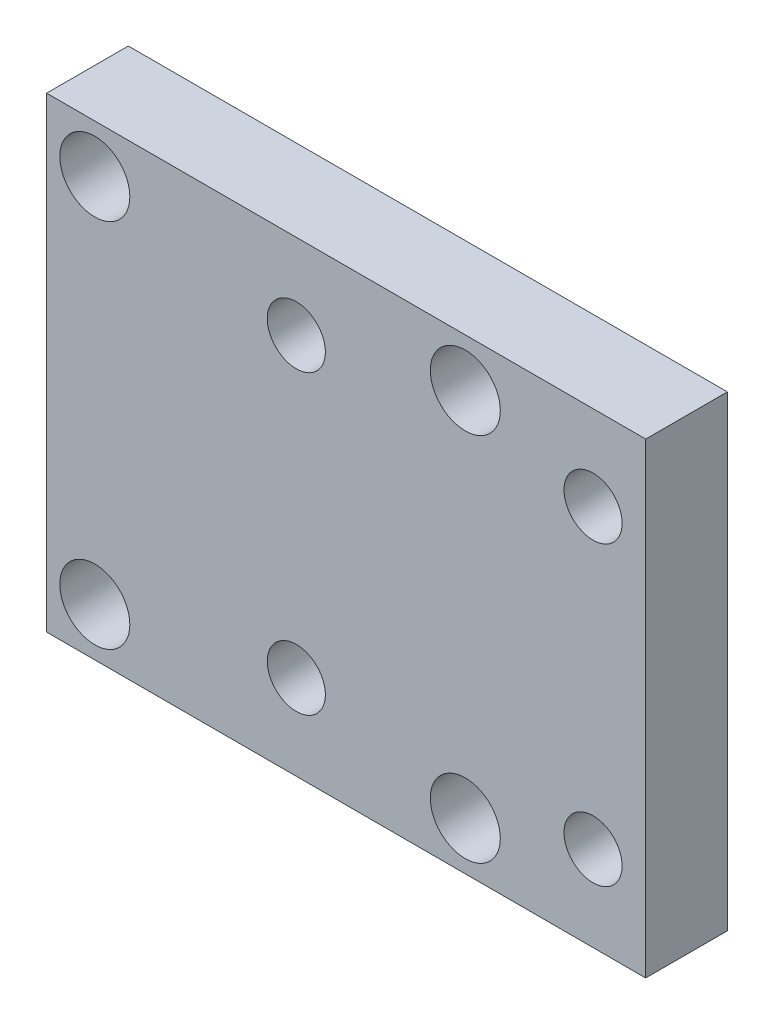
ISO-10303-21;
HEADER;
FILE_DESCRIPTION(('STEP AP214'),'2;1');
FILE_NAME('part.step','',(''),(''),'','','');
FILE_SCHEMA(('AUTOMOTIVE_DESIGN { 1 0 10303 214 1 1 1 1 }'));
ENDSEC;
DATA;
#1=APPLICATION_CONTEXT('core data for automotive mechanical design processes');
#2=APPLICATION_PROTOCOL_DEFINITION('international standard','automotive_design',2000,#1);
#3=PRODUCT_CONTEXT('',#1,'mechanical');
#4=PRODUCT('Part','Part','',(#3));
#5=PRODUCT_RELATED_PRODUCT_CATEGORY('part','',(#4));
#6=PRODUCT_DEFINITION_FORMATION('','',#4);
#7=PRODUCT_DEFINITION_CONTEXT('part definition',#1,'design');
#8=PRODUCT_DEFINITION('design','',#6,#7);
#9=PRODUCT_DEFINITION_SHAPE('','',#8);
#10=(LENGTH_UNIT() NAMED_UNIT(*) SI_UNIT(.MILLI.,.METRE.));
#11=(NAMED_UNIT(*) PLANE_ANGLE_UNIT() SI_UNIT($,.RADIAN.));
#12=(NAMED_UNIT(*) SI_UNIT($,.STERADIAN.) SOLID_ANGLE_UNIT());
#13=UNCERTAINTY_MEASURE_WITH_UNIT(LENGTH_MEASURE(1.E-05),#10,'distance_accuracy_value','');
#14=(GEOMETRIC_REPRESENTATION_CONTEXT(3) GLOBAL_UNCERTAINTY_ASSIGNED_CONTEXT((#13)) GLOBAL_UNIT_ASSIGNED_CONTEXT((#10,
#11,#12)) REPRESENTATION_CONTEXT('',''));
#15=CARTESIAN_POINT('',(0.,0.,0.));
#16=DIRECTION('',(0.,0.,1.));
#17=DIRECTION('',(1.,0.,0.));
#18=AXIS2_PLACEMENT_3D('',#15,#16,#17);
#19=CARTESIAN_POINT('',(-61.3,-35.875,7.));
#20=DIRECTION('',(0.,0.,-1.));
#21=DIRECTION('',(-1.,0.,0.));
#22=AXIS2_PLACEMENT_3D('',#19,#20,#21);
#23=CYLINDRICAL_SURFACE('',#22,2.);
#24=CARTESIAN_POINT('',(-61.3,-35.875,0.));
#25=DIRECTION('',(0.,0.,1.));
#26=DIRECTION('',(1.,0.,0.));
#27=AXIS2_PLACEMENT_3D('',#24,#25,#26);
#28=CIRCLE('',#27,2.);
#29=CARTESIAN_POINT('',(-59.3,-35.875,0.));
#30=VERTEX_POINT('',#29);
#31=EDGE_CURVE('E104',#30,#30,#28,.T.);
#32=ORIENTED_EDGE('',*,*,#31,.F.);
#33=EDGE_LOOP('',(#32));
#34=FACE_BOUND('',#33,.T.);
#35=CARTESIAN_POINT('',(-61.3,-35.875,1.));
#36=DIRECTION('',(0.,0.,1.));
#37=DIRECTION('',(1.,0.,0.));
#38=AXIS2_PLACEMENT_3D('',#35,#36,#37);
#39=CIRCLE('',#38,2.);
#40=CARTESIAN_POINT('',(-59.3,-35.875,1.));
#41=VERTEX_POINT('',#40);
#42=EDGE_CURVE('E38',#41,#41,#39,.T.);
#43=ORIENTED_EDGE('',*,*,#42,.T.);
#44=EDGE_LOOP('',(#43));
#45=FACE_BOUND('',#44,.T.);
#46=ADVANCED_FACE('F34',(#34,#45),#23,.F.);
#47=CARTESIAN_POINT('',(-29.55,-35.875,7.));
#48=DIRECTION('',(0.,0.,-1.));
#49=DIRECTION('',(-1.,0.,0.));
#50=AXIS2_PLACEMENT_3D('',#47,#48,#49);
#51=CYLINDRICAL_SURFACE('',#50,2.);
#52=CARTESIAN_POINT('',(-29.55,-35.875,0.));
#53=DIRECTION('',(0.,0.,1.));
#54=DIRECTION('',(1.,0.,0.));
#55=AXIS2_PLACEMENT_3D('',#52,#53,#54);
#56=CIRCLE('',#55,2.);
#57=CARTESIAN_POINT('',(-27.55,-35.875,0.));
#58=VERTEX_POINT('',#57);
#59=EDGE_CURVE('E149',#58,#58,#56,.T.);
#60=ORIENTED_EDGE('',*,*,#59,.F.);
#61=EDGE_LOOP('',(#60));
#62=FACE_BOUND('',#61,.T.);
#63=CARTESIAN_POINT('',(-29.55,-35.875,1.));
#64=DIRECTION('',(0.,0.,1.));
#65=DIRECTION('',(1.,0.,0.));
#66=AXIS2_PLACEMENT_3D('',#63,#64,#65);
#67=CIRCLE('',#66,2.);
#68=CARTESIAN_POINT('',(-27.55,-35.875,1.));
#69=VERTEX_POINT('',#68);
#70=EDGE_CURVE('E119',#69,#69,#67,.T.);
#71=ORIENTED_EDGE('',*,*,#70,.T.);
#72=EDGE_LOOP('',(#71));
#73=FACE_BOUND('',#72,.T.);
#74=ADVANCED_FACE('F160',(#62,#73),#51,.F.);
#75=CARTESIAN_POINT('',(-29.5500000000001,-4.12500000000002,7.));
#76=DIRECTION('',(0.,0.,-1.));
#77=DIRECTION('',(-1.,0.,0.));
#78=AXIS2_PLACEMENT_3D('',#75,#76,#77);
#79=CYLINDRICAL_SURFACE('',#78,2.);
#80=CARTESIAN_POINT('',(-29.5500000000001,-4.12500000000002,0.));
#81=DIRECTION('',(0.,0.,1.));
#82=DIRECTION('',(1.,0.,0.));
#83=AXIS2_PLACEMENT_3D('',#80,#81,#82);
#84=CIRCLE('',#83,2.);
#85=CARTESIAN_POINT('',(-27.5500000000001,-4.12500000000002,0.));
#86=VERTEX_POINT('',#85);
#87=EDGE_CURVE('E146',#86,#86,#84,.T.);
#88=ORIENTED_EDGE('',*,*,#87,.F.);
#89=EDGE_LOOP('',(#88));
#90=FACE_BOUND('',#89,.T.);
#91=CARTESIAN_POINT('',(-29.5500000000001,-4.12500000000002,1.));
#92=DIRECTION('',(0.,0.,1.));
#93=DIRECTION('',(1.,0.,0.));
#94=AXIS2_PLACEMENT_3D('',#91,#92,#93);
#95=CIRCLE('',#94,2.);
#96=CARTESIAN_POINT('',(-27.5500000000001,-4.12500000000002,1.));
#97=VERTEX_POINT('',#96);
#98=EDGE_CURVE('E115',#97,#97,#95,.T.);
#99=ORIENTED_EDGE('',*,*,#98,.T.);
#100=EDGE_LOOP('',(#99));
#101=FACE_BOUND('',#100,.T.);
#102=ADVANCED_FACE('F236',(#90,#101),#79,.F.);
#103=CARTESIAN_POINT('',(-61.3000000000001,-4.12500000000002,7.));
#104=DIRECTION('',(0.,0.,-1.));
#105=DIRECTION('',(-1.,0.,0.));
#106=AXIS2_PLACEMENT_3D('',#103,#104,#105);
#107=CYLINDRICAL_SURFACE('',#106,2.);
#108=CARTESIAN_POINT('',(-61.3000000000001,-4.12500000000002,0.));
#109=DIRECTION('',(0.,0.,1.));
#110=DIRECTION('',(1.,0.,0.));
#111=AXIS2_PLACEMENT_3D('',#108,#109,#110);
#112=CIRCLE('',#111,2.);
#113=CARTESIAN_POINT('',(-59.3000000000001,-4.12500000000002,0.));
#114=VERTEX_POINT('',#113);
#115=EDGE_CURVE('E113',#114,#114,#112,.T.);
#116=ORIENTED_EDGE('',*,*,#115,.F.);
#117=EDGE_LOOP('',(#116));
#118=FACE_BOUND('',#117,.T.);
#119=CARTESIAN_POINT('',(-61.3000000000001,-4.12500000000002,1.));
#120=DIRECTION('',(0.,0.,1.));
#121=DIRECTION('',(1.,0.,0.));
#122=AXIS2_PLACEMENT_3D('',#119,#120,#121);
#123=CIRCLE('',#122,2.);
#124=CARTESIAN_POINT('',(-59.3000000000001,-4.12500000000002,1.));
#125=VERTEX_POINT('',#124);
#126=EDGE_CURVE('E110',#125,#125,#123,.T.);
#127=ORIENTED_EDGE('',*,*,#126,.T.);
#128=EDGE_LOOP('',(#127));
#129=FACE_BOUND('',#128,.T.);
#130=ADVANCED_FACE('F201',(#118,#129),#107,.F.);
#131=CARTESIAN_POINT('',(0.,0.,7.));
#132=DIRECTION('',(0.,0.,-1.));
#133=DIRECTION('',(-1.,0.,0.));
#134=AXIS2_PLACEMENT_3D('',#131,#132,#133);
#135=PLANE('',#134);
#136=CARTESIAN_POINT('',(-18.6008068844062,-32.6999999999024,7.));
#137=DIRECTION('',(0.,0.,1.));
#138=DIRECTION('',(1.,0.,0.));
#139=AXIS2_PLACEMENT_3D('',#136,#137,#138);
#140=CIRCLE('',#139,2.49);
#141=CARTESIAN_POINT('',(-16.1108068844062,-32.6999999999024,7.));
#142=VERTEX_POINT('',#141);
#143=EDGE_CURVE('E192',#142,#142,#140,.T.);
#144=ORIENTED_EDGE('',*,*,#143,.F.);
#145=EDGE_LOOP('',(#144));
#146=FACE_BOUND('',#145,.T.);
#147=CARTESIAN_POINT('',(-44.0308068844062,-32.6999999999025,7.));
#148=DIRECTION('',(0.,0.,1.));
#149=DIRECTION('',(1.,0.,0.));
#150=AXIS2_PLACEMENT_3D('',#147,#148,#149);
#151=CIRCLE('',#150,2.49);
#152=CARTESIAN_POINT('',(-41.5408068844062,-32.6999999999025,7.));
#153=VERTEX_POINT('',#152);
#154=EDGE_CURVE('E186',#153,#153,#151,.T.);
#155=ORIENTED_EDGE('',*,*,#154,.F.);
#156=EDGE_LOOP('',(#155));
#157=FACE_BOUND('',#156,.T.);
#158=CARTESIAN_POINT('',(-44.0308068844065,-7.26999999990253,7.));
#159=DIRECTION('',(0.,0.,1.));
#160=DIRECTION('',(1.,0.,0.));
#161=AXIS2_PLACEMENT_3D('',#158,#159,#160);
#162=CIRCLE('',#161,2.49);
#163=CARTESIAN_POINT('',(-41.5408068844065,-7.26999999990253,7.));
#164=VERTEX_POINT('',#163);
#165=EDGE_CURVE('E180',#164,#164,#162,.T.);
#166=ORIENTED_EDGE('',*,*,#165,.F.);
#167=EDGE_LOOP('',(#166));
#168=FACE_BOUND('',#167,.T.);
#169=CARTESIAN_POINT('',(-18.6008068844065,-7.26999999990236,7.));
#170=DIRECTION('',(0.,0.,1.));
#171=DIRECTION('',(1.,0.,0.));
#172=AXIS2_PLACEMENT_3D('',#169,#170,#171);
#173=CIRCLE('',#172,2.49);
#174=CARTESIAN_POINT('',(-16.1108068844065,-7.26999999990236,7.));
#175=VERTEX_POINT('',#174);
#176=EDGE_CURVE('E174',#175,#175,#173,.T.);
#177=ORIENTED_EDGE('',*,*,#176,.F.);
#178=EDGE_LOOP('',(#177));
#179=FACE_BOUND('',#178,.T.);
#180=CARTESIAN_POINT('',(-61.2999999999998,-35.875,7.));
#181=DIRECTION('',(0.,0.,1.));
#182=DIRECTION('',(1.,0.,0.));
#183=AXIS2_PLACEMENT_3D('',#180,#181,#182);
#184=CIRCLE('',#183,3.);
#185=CARTESIAN_POINT('',(-58.2999999999998,-35.875,7.));
#186=VERTEX_POINT('',#185);
#187=EDGE_CURVE('E135',#186,#186,#184,.T.);
#188=ORIENTED_EDGE('',*,*,#187,.F.);
#189=EDGE_LOOP('',(#188));
#190=FACE_BOUND('',#189,.T.);
#191=CARTESIAN_POINT('',(-29.5499999999998,-35.875,7.));
#192=DIRECTION('',(0.,0.,1.));
#193=DIRECTION('',(1.,0.,0.));
#194=AXIS2_PLACEMENT_3D('',#191,#192,#193);
#195=CIRCLE('',#194,3.);
#196=CARTESIAN_POINT('',(-26.5499999999998,-35.875,7.));
#197=VERTEX_POINT('',#196);
#198=EDGE_CURVE('E128',#197,#197,#195,.T.);
#199=ORIENTED_EDGE('',*,*,#198,.F.);
#200=EDGE_LOOP('',(#199));
#201=FACE_BOUND('',#200,.T.);
#202=CARTESIAN_POINT('',(-29.5500000000001,-4.12500000000002,7.));
#203=DIRECTION('',(0.,0.,1.));
#204=DIRECTION('',(1.,0.,0.));
#205=AXIS2_PLACEMENT_3D('',#202,#203,#204);
#206=CIRCLE('',#205,3.);
#207=CARTESIAN_POINT('',(-26.5500000000001,-4.12500000000002,7.));
#208=VERTEX_POINT('',#207);
#209=EDGE_CURVE('E121',#208,#208,#206,.T.);
#210=ORIENTED_EDGE('',*,*,#209,.F.);
#211=EDGE_LOOP('',(#210));
#212=FACE_BOUND('',#211,.T.);
#213=CARTESIAN_POINT('',(-61.3000000000001,-4.12500000000002,7.));
#214=DIRECTION('',(0.,0.,1.));
#215=DIRECTION('',(1.,0.,0.));
#216=AXIS2_PLACEMENT_3D('',#213,#214,#215);
#217=CIRCLE('',#216,3.);
#218=CARTESIAN_POINT('',(-58.3000000000001,-4.12500000000002,7.));
#219=VERTEX_POINT('',#218);
#220=EDGE_CURVE('E117',#219,#219,#217,.T.);
#221=ORIENTED_EDGE('',*,*,#220,.F.);
#222=EDGE_LOOP('',(#221));
#223=FACE_BOUND('',#222,.T.);
#224=DIRECTION('',(0.,1.,0.));
#225=VECTOR('',#224,1.);
#226=CARTESIAN_POINT('',(-14.09,0.,7.));
#227=LINE('',#226,#225);
#228=CARTESIAN_POINT('',(-14.09,-40.,7.));
#229=VERTEX_POINT('',#228);
#230=CARTESIAN_POINT('',(-14.09,0.,7.));
#231=VERTEX_POINT('',#230);
#232=EDGE_CURVE('E88',#229,#231,#227,.T.);
#233=ORIENTED_EDGE('',*,*,#232,.T.);
#234=DIRECTION('',(-1.,0.,0.));
#235=VECTOR('',#234,1.);
#236=CARTESIAN_POINT('',(-14.09,0.,7.));
#237=LINE('',#236,#235);
#238=CARTESIAN_POINT('',(-65.43,0.,7.));
#239=VERTEX_POINT('',#238);
#240=EDGE_CURVE('E83',#231,#239,#237,.T.);
#241=ORIENTED_EDGE('',*,*,#240,.T.);
#242=DIRECTION('',(0.,-1.,0.));
#243=VECTOR('',#242,1.);
#244=CARTESIAN_POINT('',(-65.43,0.,7.));
#245=LINE('',#244,#243);
#246=CARTESIAN_POINT('',(-65.43,-40.,7.));
#247=VERTEX_POINT('',#246);
#248=EDGE_CURVE('E86',#239,#247,#245,.T.);
#249=ORIENTED_EDGE('',*,*,#248,.T.);
#250=DIRECTION('',(1.,0.,0.));
#251=VECTOR('',#250,1.);
#252=CARTESIAN_POINT('',(-14.09,-40.,7.));
#253=LINE('',#252,#251);
#254=EDGE_CURVE('E53',#247,#229,#253,.T.);
#255=ORIENTED_EDGE('',*,*,#254,.T.);
#256=EDGE_LOOP('',(#233,#241,#249,#255));
#257=FACE_BOUND('',#256,.T.);
#258=ADVANCED_FACE('F84',(#146,#157,#168,#179,#190,#201,#212,#223,#257),#135,.F.);
#259=CARTESIAN_POINT('',(0.,0.,0.));
#260=DIRECTION('',(0.,0.,-1.));
#261=DIRECTION('',(-1.,0.,0.));
#262=AXIS2_PLACEMENT_3D('',#259,#260,#261);
#263=PLANE('',#262);
#264=CARTESIAN_POINT('',(-18.6008068844062,-32.6999999999024,0.));
#265=DIRECTION('',(0.,0.,-1.));
#266=DIRECTION('',(-1.,0.,0.));
#267=AXIS2_PLACEMENT_3D('',#264,#265,#266);
#268=CIRCLE('',#267,2.49);
#269=CARTESIAN_POINT('',(-21.0908068844062,-32.6999999999024,0.));
#270=VERTEX_POINT('',#269);
#271=EDGE_CURVE('E189',#270,#270,#268,.F.);
#272=ORIENTED_EDGE('',*,*,#271,.T.);
#273=EDGE_LOOP('',(#272));
#274=FACE_BOUND('',#273,.T.);
#275=CARTESIAN_POINT('',(-44.0308068844062,-32.6999999999025,0.));
#276=DIRECTION('',(0.,0.,-1.));
#277=DIRECTION('',(-1.,0.,0.));
#278=AXIS2_PLACEMENT_3D('',#275,#276,#277);
#279=CIRCLE('',#278,2.49);
#280=CARTESIAN_POINT('',(-46.5208068844062,-32.6999999999025,0.));
#281=VERTEX_POINT('',#280);
#282=EDGE_CURVE('E183',#281,#281,#279,.F.);
#283=ORIENTED_EDGE('',*,*,#282,.T.);
#284=EDGE_LOOP('',(#283));
#285=FACE_BOUND('',#284,.T.);
#286=CARTESIAN_POINT('',(-44.0308068844065,-7.26999999990253,0.));
#287=DIRECTION('',(0.,0.,-1.));
#288=DIRECTION('',(-1.,0.,0.));
#289=AXIS2_PLACEMENT_3D('',#286,#287,#288);
#290=CIRCLE('',#289,2.49);
#291=CARTESIAN_POINT('',(-46.5208068844065,-7.26999999990253,0.));
#292=VERTEX_POINT('',#291);
#293=EDGE_CURVE('E177',#292,#292,#290,.F.);
#294=ORIENTED_EDGE('',*,*,#293,.T.);
#295=EDGE_LOOP('',(#294));
#296=FACE_BOUND('',#295,.T.);
#297=CARTESIAN_POINT('',(-18.6008068844065,-7.26999999990236,0.));
#298=DIRECTION('',(0.,0.,-1.));
#299=DIRECTION('',(-1.,0.,0.));
#300=AXIS2_PLACEMENT_3D('',#297,#298,#299);
#301=CIRCLE('',#300,2.49);
#302=CARTESIAN_POINT('',(-21.0908068844065,-7.26999999990236,0.));
#303=VERTEX_POINT('',#302);
#304=EDGE_CURVE('E170',#303,#303,#301,.F.);
#305=ORIENTED_EDGE('',*,*,#304,.T.);
#306=EDGE_LOOP('',(#305));
#307=FACE_BOUND('',#306,.T.);
#308=ORIENTED_EDGE('',*,*,#87,.T.);
#309=EDGE_LOOP('',(#308));
#310=FACE_BOUND('',#309,.T.);
#311=ORIENTED_EDGE('',*,*,#31,.T.);
#312=EDGE_LOOP('',(#311));
#313=FACE_BOUND('',#312,.T.);
#314=DIRECTION('',(0.,1.,0.));
#315=VECTOR('',#314,1.);
#316=CARTESIAN_POINT('',(-14.09,0.,0.));
#317=LINE('',#316,#315);
#318=CARTESIAN_POINT('',(-14.09,-40.,0.));
#319=VERTEX_POINT('',#318);
#320=CARTESIAN_POINT('',(-14.09,0.,0.));
#321=VERTEX_POINT('',#320);
#322=EDGE_CURVE('E101',#319,#321,#317,.T.);
#323=ORIENTED_EDGE('',*,*,#322,.F.);
#324=DIRECTION('',(1.,0.,0.));
#325=VECTOR('',#324,1.);
#326=CARTESIAN_POINT('',(-14.09,-40.,0.));
#327=LINE('',#326,#325);
#328=CARTESIAN_POINT('',(-65.43,-40.,0.));
#329=VERTEX_POINT('',#328);
#330=EDGE_CURVE('E76',#329,#319,#327,.T.);
#331=ORIENTED_EDGE('',*,*,#330,.F.);
#332=DIRECTION('',(0.,-1.,0.));
#333=VECTOR('',#332,1.);
#334=CARTESIAN_POINT('',(-65.43,0.,0.));
#335=LINE('',#334,#333);
#336=CARTESIAN_POINT('',(-65.43,0.,0.));
#337=VERTEX_POINT('',#336);
#338=EDGE_CURVE('E70',#337,#329,#335,.T.);
#339=ORIENTED_EDGE('',*,*,#338,.F.);
#340=DIRECTION('',(-1.,0.,0.));
#341=VECTOR('',#340,1.);
#342=CARTESIAN_POINT('',(-14.09,0.,0.));
#343=LINE('',#342,#341);
#344=EDGE_CURVE('E92',#321,#337,#343,.T.);
#345=ORIENTED_EDGE('',*,*,#344,.F.);
#346=EDGE_LOOP('',(#323,#331,#339,#345));
#347=FACE_BOUND('',#346,.T.);
#348=ORIENTED_EDGE('',*,*,#59,.T.);
#349=EDGE_LOOP('',(#348));
#350=FACE_BOUND('',#349,.T.);
#351=ORIENTED_EDGE('',*,*,#115,.T.);
#352=EDGE_LOOP('',(#351));
#353=FACE_BOUND('',#352,.T.);
#354=ADVANCED_FACE('F155',(#274,#285,#296,#307,#310,#313,#347,#350,#353),#263,.T.);
#355=CARTESIAN_POINT('',(-14.09,0.,7.));
#356=DIRECTION('',(-1.,0.,0.));
#357=DIRECTION('',(0.,-1.,0.));
#358=AXIS2_PLACEMENT_3D('',#355,#356,#357);
#359=PLANE('',#358);
#360=ORIENTED_EDGE('',*,*,#322,.T.);
#361=DIRECTION('',(0.,0.,-1.));
#362=VECTOR('',#361,1.);
#363=CARTESIAN_POINT('',(-14.09,0.,7.));
#364=LINE('',#363,#362);
#365=EDGE_CURVE('E11',#231,#321,#364,.T.);
#366=ORIENTED_EDGE('',*,*,#365,.F.);
#367=ORIENTED_EDGE('',*,*,#232,.F.);
#368=DIRECTION('',(0.,0.,-1.));
#369=VECTOR('',#368,1.);
#370=CARTESIAN_POINT('',(-14.09,-40.,7.));
#371=LINE('',#370,#369);
#372=EDGE_CURVE('E97',#229,#319,#371,.T.);
#373=ORIENTED_EDGE('',*,*,#372,.T.);
#374=EDGE_LOOP('',(#360,#366,#367,#373));
#375=FACE_BOUND('',#374,.T.);
#376=ADVANCED_FACE('F36',(#375),#359,.F.);
#377=CARTESIAN_POINT('',(-14.09,0.,7.));
#378=DIRECTION('',(0.,-1.,0.));
#379=DIRECTION('',(1.,0.,0.));
#380=AXIS2_PLACEMENT_3D('',#377,#378,#379);
#381=PLANE('',#380);
#382=ORIENTED_EDGE('',*,*,#344,.T.);
#383=DIRECTION('',(0.,0.,-1.));
#384=VECTOR('',#383,1.);
#385=CARTESIAN_POINT('',(-65.43,0.,7.));
#386=LINE('',#385,#384);
#387=EDGE_CURVE('E44',#239,#337,#386,.T.);
#388=ORIENTED_EDGE('',*,*,#387,.F.);
#389=ORIENTED_EDGE('',*,*,#240,.F.);
#390=ORIENTED_EDGE('',*,*,#365,.T.);
#391=EDGE_LOOP('',(#382,#388,#389,#390));
#392=FACE_BOUND('',#391,.T.);
#393=ADVANCED_FACE('F91',(#392),#381,.F.);
#394=CARTESIAN_POINT('',(-65.43,0.,7.));
#395=DIRECTION('',(1.,0.,0.));
#396=DIRECTION('',(0.,1.,0.));
#397=AXIS2_PLACEMENT_3D('',#394,#395,#396);
#398=PLANE('',#397);
#399=ORIENTED_EDGE('',*,*,#338,.T.);
#400=DIRECTION('',(0.,0.,-1.));
#401=VECTOR('',#400,1.);
#402=CARTESIAN_POINT('',(-65.43,-40.,7.));
#403=LINE('',#402,#401);
#404=EDGE_CURVE('E93',#247,#329,#403,.T.);
#405=ORIENTED_EDGE('',*,*,#404,.F.);
#406=ORIENTED_EDGE('',*,*,#248,.F.);
#407=ORIENTED_EDGE('',*,*,#387,.T.);
#408=EDGE_LOOP('',(#399,#405,#406,#407));
#409=FACE_BOUND('',#408,.T.);
#410=ADVANCED_FACE('F95',(#409),#398,.F.);
#411=CARTESIAN_POINT('',(-14.09,-40.,7.));
#412=DIRECTION('',(0.,1.,0.));
#413=DIRECTION('',(-1.,0.,0.));
#414=AXIS2_PLACEMENT_3D('',#411,#412,#413);
#415=PLANE('',#414);
#416=ORIENTED_EDGE('',*,*,#330,.T.);
#417=ORIENTED_EDGE('',*,*,#372,.F.);
#418=ORIENTED_EDGE('',*,*,#254,.F.);
#419=ORIENTED_EDGE('',*,*,#404,.T.);
#420=EDGE_LOOP('',(#416,#417,#418,#419));
#421=FACE_BOUND('',#420,.T.);
#422=ADVANCED_FACE('F220',(#421),#415,.F.);
#423=CARTESIAN_POINT('',(-61.3000000000001,-4.12500000000002,1.));
#424=DIRECTION('',(0.,0.,1.));
#425=DIRECTION('',(1.,0.,0.));
#426=AXIS2_PLACEMENT_3D('',#423,#424,#425);
#427=CYLINDRICAL_SURFACE('',#426,3.);
#428=CARTESIAN_POINT('',(-61.3000000000001,-4.12500000000002,1.));
#429=DIRECTION('',(0.,0.,1.));
#430=DIRECTION('',(1.,0.,0.));
#431=AXIS2_PLACEMENT_3D('',#428,#429,#430);
#432=CIRCLE('',#431,3.);
#433=CARTESIAN_POINT('',(-58.3000000000001,-4.12500000000002,1.));
#434=VERTEX_POINT('',#433);
#435=EDGE_CURVE('E114',#434,#434,#432,.T.);
#436=ORIENTED_EDGE('',*,*,#435,.F.);
#437=EDGE_LOOP('',(#436));
#438=FACE_BOUND('',#437,.T.);
#439=ORIENTED_EDGE('',*,*,#220,.T.);
#440=EDGE_LOOP('',(#439));
#441=FACE_BOUND('',#440,.T.);
#442=ADVANCED_FACE('F217',(#438,#441),#427,.F.);
#443=CARTESIAN_POINT('',(-61.3000000000001,-4.12500000000002,1.));
#444=DIRECTION('',(0.,0.,1.));
#445=DIRECTION('',(1.,0.,0.));
#446=AXIS2_PLACEMENT_3D('',#443,#444,#445);
#447=PLANE('',#446);
#448=ORIENTED_EDGE('',*,*,#126,.F.);
#449=EDGE_LOOP('',(#448));
#450=FACE_BOUND('',#449,.T.);
#451=ORIENTED_EDGE('',*,*,#435,.T.);
#452=EDGE_LOOP('',(#451));
#453=FACE_BOUND('',#452,.T.);
#454=ADVANCED_FACE('F219',(#450,#453),#447,.T.);
#455=CARTESIAN_POINT('',(-29.5500000000001,-4.12500000000002,1.));
#456=DIRECTION('',(0.,0.,1.));
#457=DIRECTION('',(1.,0.,0.));
#458=AXIS2_PLACEMENT_3D('',#455,#456,#457);
#459=CYLINDRICAL_SURFACE('',#458,3.);
#460=CARTESIAN_POINT('',(-29.5500000000001,-4.12500000000002,1.));
#461=DIRECTION('',(0.,0.,1.));
#462=DIRECTION('',(1.,0.,0.));
#463=AXIS2_PLACEMENT_3D('',#460,#461,#462);
#464=CIRCLE('',#463,3.);
#465=CARTESIAN_POINT('',(-26.5500000000001,-4.12500000000002,1.));
#466=VERTEX_POINT('',#465);
#467=EDGE_CURVE('E118',#466,#466,#464,.T.);
#468=ORIENTED_EDGE('',*,*,#467,.F.);
#469=EDGE_LOOP('',(#468));
#470=FACE_BOUND('',#469,.T.);
#471=ORIENTED_EDGE('',*,*,#209,.T.);
#472=EDGE_LOOP('',(#471));
#473=FACE_BOUND('',#472,.T.);
#474=ADVANCED_FACE('F227',(#470,#473),#459,.F.);
#475=CARTESIAN_POINT('',(-29.5500000000001,-4.12500000000002,1.));
#476=DIRECTION('',(0.,0.,1.));
#477=DIRECTION('',(1.,0.,0.));
#478=AXIS2_PLACEMENT_3D('',#475,#476,#477);
#479=PLANE('',#478);
#480=ORIENTED_EDGE('',*,*,#98,.F.);
#481=EDGE_LOOP('',(#480));
#482=FACE_BOUND('',#481,.T.);
#483=ORIENTED_EDGE('',*,*,#467,.T.);
#484=EDGE_LOOP('',(#483));
#485=FACE_BOUND('',#484,.T.);
#486=ADVANCED_FACE('F361',(#482,#485),#479,.T.);
#487=CARTESIAN_POINT('',(-29.5499999999998,-35.875,1.));
#488=DIRECTION('',(0.,0.,1.));
#489=DIRECTION('',(1.,0.,0.));
#490=AXIS2_PLACEMENT_3D('',#487,#488,#489);
#491=CYLINDRICAL_SURFACE('',#490,3.);
#492=CARTESIAN_POINT('',(-29.5499999999998,-35.875,1.));
#493=DIRECTION('',(0.,0.,1.));
#494=DIRECTION('',(1.,0.,0.));
#495=AXIS2_PLACEMENT_3D('',#492,#493,#494);
#496=CIRCLE('',#495,3.);
#497=CARTESIAN_POINT('',(-26.5499999999998,-35.875,1.));
#498=VERTEX_POINT('',#497);
#499=EDGE_CURVE('E122',#498,#498,#496,.T.);
#500=ORIENTED_EDGE('',*,*,#499,.F.);
#501=EDGE_LOOP('',(#500));
#502=FACE_BOUND('',#501,.T.);
#503=ORIENTED_EDGE('',*,*,#198,.T.);
#504=EDGE_LOOP('',(#503));
#505=FACE_BOUND('',#504,.T.);
#506=ADVANCED_FACE('F351',(#502,#505),#491,.F.);
#507=CARTESIAN_POINT('',(-29.5499999999998,-35.875,1.));
#508=DIRECTION('',(0.,0.,1.));
#509=DIRECTION('',(1.,0.,0.));
#510=AXIS2_PLACEMENT_3D('',#507,#508,#509);
#511=PLANE('',#510);
#512=ORIENTED_EDGE('',*,*,#70,.F.);
#513=EDGE_LOOP('',(#512));
#514=FACE_BOUND('',#513,.T.);
#515=ORIENTED_EDGE('',*,*,#499,.T.);
#516=EDGE_LOOP('',(#515));
#517=FACE_BOUND('',#516,.T.);
#518=ADVANCED_FACE('F341',(#514,#517),#511,.T.);
#519=CARTESIAN_POINT('',(-61.2999999999998,-35.875,1.));
#520=DIRECTION('',(0.,0.,1.));
#521=DIRECTION('',(1.,0.,0.));
#522=AXIS2_PLACEMENT_3D('',#519,#520,#521);
#523=CYLINDRICAL_SURFACE('',#522,3.);
#524=CARTESIAN_POINT('',(-61.2999999999998,-35.875,1.));
#525=DIRECTION('',(0.,0.,1.));
#526=DIRECTION('',(1.,0.,0.));
#527=AXIS2_PLACEMENT_3D('',#524,#525,#526);
#528=CIRCLE('',#527,3.);
#529=CARTESIAN_POINT('',(-58.2999999999998,-35.875,1.));
#530=VERTEX_POINT('',#529);
#531=EDGE_CURVE('E165',#530,#530,#528,.T.);
#532=ORIENTED_EDGE('',*,*,#531,.F.);
#533=EDGE_LOOP('',(#532));
#534=FACE_BOUND('',#533,.T.);
#535=ORIENTED_EDGE('',*,*,#187,.T.);
#536=EDGE_LOOP('',(#535));
#537=FACE_BOUND('',#536,.T.);
#538=ADVANCED_FACE('F330',(#534,#537),#523,.F.);
#539=CARTESIAN_POINT('',(-61.2999999999998,-35.875,1.));
#540=DIRECTION('',(0.,0.,1.));
#541=DIRECTION('',(1.,0.,0.));
#542=AXIS2_PLACEMENT_3D('',#539,#540,#541);
#543=PLANE('',#542);
#544=ORIENTED_EDGE('',*,*,#42,.F.);
#545=EDGE_LOOP('',(#544));
#546=FACE_BOUND('',#545,.T.);
#547=ORIENTED_EDGE('',*,*,#531,.T.);
#548=EDGE_LOOP('',(#547));
#549=FACE_BOUND('',#548,.T.);
#550=ADVANCED_FACE('F324',(#546,#549),#543,.T.);
#551=CARTESIAN_POINT('',(-18.6008068844065,-7.26999999990236,-7.04278354061801));
#552=DIRECTION('',(0.,0.,1.));
#553=DIRECTION('',(1.,0.,0.));
#554=AXIS2_PLACEMENT_3D('',#551,#552,#553);
#555=CYLINDRICAL_SURFACE('',#554,2.49);
#556=ORIENTED_EDGE('',*,*,#176,.T.);
#557=EDGE_LOOP('',(#556));
#558=FACE_BOUND('',#557,.T.);
#559=ORIENTED_EDGE('',*,*,#304,.F.);
#560=EDGE_LOOP('',(#559));
#561=FACE_BOUND('',#560,.T.);
#562=ADVANCED_FACE('F329',(#558,#561),#555,.F.);
#563=CARTESIAN_POINT('',(-44.0308068844065,-7.26999999990253,-7.04278354061801));
#564=DIRECTION('',(0.,0.,1.));
#565=DIRECTION('',(1.,0.,0.));
#566=AXIS2_PLACEMENT_3D('',#563,#564,#565);
#567=CYLINDRICAL_SURFACE('',#566,2.49);
#568=ORIENTED_EDGE('',*,*,#165,.T.);
#569=EDGE_LOOP('',(#568));
#570=FACE_BOUND('',#569,.T.);
#571=ORIENTED_EDGE('',*,*,#293,.F.);
#572=EDGE_LOOP('',(#571));
#573=FACE_BOUND('',#572,.T.);
#574=ADVANCED_FACE('F396',(#570,#573),#567,.F.);
#575=CARTESIAN_POINT('',(-44.0308068844062,-32.6999999999025,-7.04278354061801));
#576=DIRECTION('',(0.,0.,1.));
#577=DIRECTION('',(1.,0.,0.));
#578=AXIS2_PLACEMENT_3D('',#575,#576,#577);
#579=CYLINDRICAL_SURFACE('',#578,2.49);
#580=ORIENTED_EDGE('',*,*,#154,.T.);
#581=EDGE_LOOP('',(#580));
#582=FACE_BOUND('',#581,.T.);
#583=ORIENTED_EDGE('',*,*,#282,.F.);
#584=EDGE_LOOP('',(#583));
#585=FACE_BOUND('',#584,.T.);
#586=ADVANCED_FACE('F400',(#582,#585),#579,.F.);
#587=CARTESIAN_POINT('',(-18.6008068844062,-32.6999999999024,-7.04278354061801));
#588=DIRECTION('',(0.,0.,1.));
#589=DIRECTION('',(1.,0.,0.));
#590=AXIS2_PLACEMENT_3D('',#587,#588,#589);
#591=CYLINDRICAL_SURFACE('',#590,2.49);
#592=ORIENTED_EDGE('',*,*,#143,.T.);
#593=EDGE_LOOP('',(#592));
#594=FACE_BOUND('',#593,.T.);
#595=ORIENTED_EDGE('',*,*,#271,.F.);
#596=EDGE_LOOP('',(#595));
#597=FACE_BOUND('',#596,.T.);
#598=ADVANCED_FACE('F196',(#594,#597),#591,.F.);
#599=CLOSED_SHELL('',(#46,#74,#102,#130,#258,#354,#376,#393,#410,#422,#442,#454,#474,#486,#506,
#518,#538,#550,#562,#574,#586,#598));
#600=MANIFOLD_SOLID_BREP('B2',#599);
#601=ADVANCED_BREP_SHAPE_REPRESENTATION('',(#18,#600),#14);
#602=SHAPE_DEFINITION_REPRESENTATION(#9,#601);
ENDSEC;
END-ISO-10303-21;
